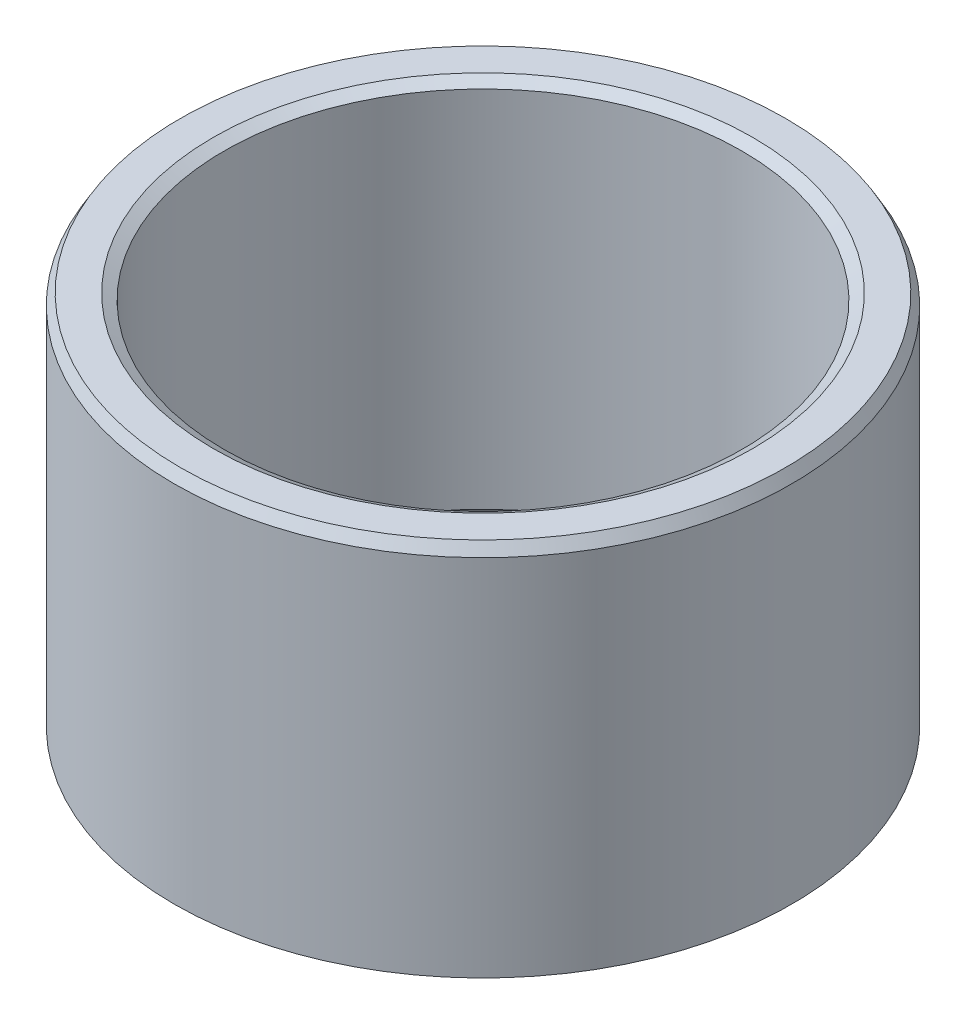
ISO-10303-21;
HEADER;
FILE_DESCRIPTION(('STEP AP214'),'2;1');
FILE_NAME('part.step','',(''),(''),'','','');
FILE_SCHEMA(('AUTOMOTIVE_DESIGN { 1 0 10303 214 1 1 1 1 }'));
ENDSEC;
DATA;
#1=APPLICATION_CONTEXT('core data for automotive mechanical design processes');
#2=APPLICATION_PROTOCOL_DEFINITION('international standard','automotive_design',2000,#1);
#3=PRODUCT_CONTEXT('',#1,'mechanical');
#4=PRODUCT('Part','Part','',(#3));
#5=PRODUCT_RELATED_PRODUCT_CATEGORY('part','',(#4));
#6=PRODUCT_DEFINITION_FORMATION('','',#4);
#7=PRODUCT_DEFINITION_CONTEXT('part definition',#1,'design');
#8=PRODUCT_DEFINITION('design','',#6,#7);
#9=PRODUCT_DEFINITION_SHAPE('','',#8);
#10=(LENGTH_UNIT() NAMED_UNIT(*) SI_UNIT(.MILLI.,.METRE.));
#11=(NAMED_UNIT(*) PLANE_ANGLE_UNIT() SI_UNIT($,.RADIAN.));
#12=(NAMED_UNIT(*) SI_UNIT($,.STERADIAN.) SOLID_ANGLE_UNIT());
#13=UNCERTAINTY_MEASURE_WITH_UNIT(LENGTH_MEASURE(1.E-05),#10,'distance_accuracy_value','');
#14=(GEOMETRIC_REPRESENTATION_CONTEXT(3) GLOBAL_UNCERTAINTY_ASSIGNED_CONTEXT((#13)) GLOBAL_UNIT_ASSIGNED_CONTEXT((#10,
#11,#12)) REPRESENTATION_CONTEXT('',''));
#15=CARTESIAN_POINT('',(0.,0.,0.));
#16=DIRECTION('',(0.,0.,1.));
#17=DIRECTION('',(1.,0.,0.));
#18=AXIS2_PLACEMENT_3D('',#15,#16,#17);
#19=CARTESIAN_POINT('',(0.,46.2879067131361,0.));
#20=DIRECTION('',(0.,-1.,0.));
#21=DIRECTION('',(0.,0.,-1.));
#22=AXIS2_PLACEMENT_3D('',#19,#20,#21);
#23=CYLINDRICAL_SURFACE('',#22,37.5);
#24=CARTESIAN_POINT('',(0.,0.763815531329169,0.));
#25=DIRECTION('',(0.,1.,0.));
#26=DIRECTION('',(0.,0.,1.));
#27=AXIS2_PLACEMENT_3D('',#24,#25,#26);
#28=CIRCLE('',#27,37.5);
#29=CARTESIAN_POINT('',(0.,0.763815531329162,-37.5));
#30=VERTEX_POINT('',#29);
#31=EDGE_CURVE('E10',#30,#30,#28,.T.);
#32=CARTESIAN_POINT('',(0.,44.9649394052639,0.));
#33=DIRECTION('',(0.,1.,0.));
#34=DIRECTION('',(0.,0.,1.));
#35=AXIS2_PLACEMENT_3D('',#32,#33,#34);
#36=CIRCLE('',#35,37.5);
#37=CARTESIAN_POINT('',(0.,44.9649394052639,-37.5));
#38=VERTEX_POINT('',#37);
#39=EDGE_CURVE('E50',#38,#38,#36,.F.);
#40=CARTESIAN_POINT('',(0.,0.763815531329162,-37.5));
#41=CARTESIAN_POINT('',(0.,1.22424390501598,-37.5));
#42=CARTESIAN_POINT('',(0.,1.6846722787028,-37.5));
#43=CARTESIAN_POINT('',(0.,2.60552902607644,-37.5));
#44=CARTESIAN_POINT('',(0.,3.06595739976326,-37.5));
#45=CARTESIAN_POINT('',(0.,3.9868141471369,-37.5));
#46=CARTESIAN_POINT('',(0.,4.44724252082372,-37.5));
#47=CARTESIAN_POINT('',(0.,5.36809926819736,-37.5));
#48=CARTESIAN_POINT('',(0.,5.82852764188418,-37.5));
#49=CARTESIAN_POINT('',(0.,6.74938438925782,-37.5));
#50=CARTESIAN_POINT('',(0.,7.20981276294464,-37.5));
#51=CARTESIAN_POINT('',(0.,8.13066951031829,-37.5));
#52=CARTESIAN_POINT('',(0.,8.59109788400511,-37.5));
#53=CARTESIAN_POINT('',(0.,9.51195463137875,-37.5));
#54=CARTESIAN_POINT('',(0.,9.97238300506557,-37.5));
#55=CARTESIAN_POINT('',(0.,10.8932397524392,-37.5));
#56=CARTESIAN_POINT('',(0.,11.353668126126,-37.5));
#57=CARTESIAN_POINT('',(0.,12.2745248734997,-37.5));
#58=CARTESIAN_POINT('',(0.,12.7349532471865,-37.5));
#59=CARTESIAN_POINT('',(0.,13.6558099945601,-37.5));
#60=CARTESIAN_POINT('',(0.,14.1162383682469,-37.5));
#61=CARTESIAN_POINT('',(0.,15.0370951156206,-37.5));
#62=CARTESIAN_POINT('',(0.,15.4975234893074,-37.5));
#63=CARTESIAN_POINT('',(0.,16.418380236681,-37.5));
#64=CARTESIAN_POINT('',(0.,16.8788086103679,-37.5));
#65=CARTESIAN_POINT('',(0.,17.7996653577415,-37.5));
#66=CARTESIAN_POINT('',(0.,18.2600937314283,-37.5));
#67=CARTESIAN_POINT('',(0.,19.180950478802,-37.5));
#68=CARTESIAN_POINT('',(0.,19.6413788524888,-37.5));
#69=CARTESIAN_POINT('',(0.,20.5622355998624,-37.5));
#70=CARTESIAN_POINT('',(0.,21.0226639735492,-37.5));
#71=CARTESIAN_POINT('',(0.,21.9435207209229,-37.5));
#72=CARTESIAN_POINT('',(0.,22.4039490946097,-37.5));
#73=CARTESIAN_POINT('',(0.,23.3248058419833,-37.5));
#74=CARTESIAN_POINT('',(0.,23.7852342156702,-37.5));
#75=CARTESIAN_POINT('',(0.,24.7060909630438,-37.5));
#76=CARTESIAN_POINT('',(0.,25.1665193367306,-37.5));
#77=CARTESIAN_POINT('',(0.,26.0873760841043,-37.5));
#78=CARTESIAN_POINT('',(0.,26.5478044577911,-37.5));
#79=CARTESIAN_POINT('',(0.,27.4686612051647,-37.5));
#80=CARTESIAN_POINT('',(0.,27.9290895788515,-37.5));
#81=CARTESIAN_POINT('',(0.,28.8499463262252,-37.5));
#82=CARTESIAN_POINT('',(0.,29.310374699912,-37.5));
#83=CARTESIAN_POINT('',(0.,30.2312314472856,-37.5));
#84=CARTESIAN_POINT('',(0.,30.6916598209725,-37.5));
#85=CARTESIAN_POINT('',(0.,31.6125165683461,-37.5));
#86=CARTESIAN_POINT('',(0.,32.0729449420329,-37.5));
#87=CARTESIAN_POINT('',(0.,32.9938016894066,-37.5));
#88=CARTESIAN_POINT('',(0.,33.4542300630934,-37.5));
#89=CARTESIAN_POINT('',(0.,34.375086810467,-37.5));
#90=CARTESIAN_POINT('',(0.,34.8355151841538,-37.5));
#91=CARTESIAN_POINT('',(0.,35.7563719315275,-37.5));
#92=CARTESIAN_POINT('',(0.,36.2168003052143,-37.5));
#93=CARTESIAN_POINT('',(0.,37.1376570525879,-37.5));
#94=CARTESIAN_POINT('',(0.,37.5980854262748,-37.5));
#95=CARTESIAN_POINT('',(0.,38.5189421736484,-37.5));
#96=CARTESIAN_POINT('',(0.,38.9793705473352,-37.5));
#97=CARTESIAN_POINT('',(0.,39.9002272947089,-37.5));
#98=CARTESIAN_POINT('',(0.,40.3606556683957,-37.5));
#99=CARTESIAN_POINT('',(0.,41.2815124157693,-37.5));
#100=CARTESIAN_POINT('',(0.,41.7419407894561,-37.5));
#101=CARTESIAN_POINT('',(0.,42.6627975368298,-37.5));
#102=CARTESIAN_POINT('',(0.,43.1232259105166,-37.5));
#103=CARTESIAN_POINT('',(0.,44.0440826578902,-37.5));
#104=CARTESIAN_POINT('',(0.,44.5045110315771,-37.5));
#105=CARTESIAN_POINT('',(0.,44.9649394052639,-37.5));
#106=B_SPLINE_CURVE_WITH_KNOTS('',3,(#40,#41,#42,#43,#44,#45,#46,#47,#48,#49,#50,#51,#52,#53,
#54,#55,#56,#57,#58,#59,#60,#61,#62,#63,#64,#65,#66,#67,#68,#69,#70,#71,#72,#73,#74,#75,#76,#77,
#78,#79,#80,#81,#82,#83,#84,#85,#86,#87,#88,#89,#90,#91,#92,#93,#94,#95,#96,#97,#98,#99,#100,
#101,#102,#103,#104,#105),.UNSPECIFIED.,.F.,.F.,(4,2,2,2,2,2,2,2,2,2,2,2,2,2,2,2,2,2,2,2,2,2,2,
2,2,2,2,2,2,2,2,2,4),(0.,1.38128512106046,2.76257024212092,4.14385536318138,5.52514048424184,
6.9064256053023,8.28771072636277,9.66899584742322,11.0502809684837,12.4315660895441,
13.8128512106046,15.1941363316651,16.5754214527255,17.956706573786,19.3379916948464,
20.7192768159069,22.1005619369674,23.4818470580278,24.8631321790883,26.2444173001487,
27.6257024212092,29.0069875422697,30.3882726633301,31.7695577843906,33.150842905451,
34.5321280265115,35.913413147572,37.2946982686324,38.6759833896929,40.0572685107533,
41.4385536318138,42.8198387528743,44.2011238739347),.UNSPECIFIED.);
#107=EDGE_CURVE('BSEAM39',#30,#38,#106,.T.);
#108=ORIENTED_EDGE('',*,*,#31,.T.);
#109=ORIENTED_EDGE('',*,*,#39,.T.);
#110=ORIENTED_EDGE('',*,*,#107,.T.);
#111=ORIENTED_EDGE('',*,*,#107,.F.);
#112=EDGE_LOOP('',(#108,#110,#109,#111));
#113=FACE_BOUND('',#112,.T.);
#114=ADVANCED_FACE('F39',(#113),#23,.T.);
#115=CARTESIAN_POINT('',(0.,46.2879067131361,0.));
#116=DIRECTION('',(0.,1.,0.));
#117=DIRECTION('',(0.,0.,1.));
#118=AXIS2_PLACEMENT_3D('',#115,#116,#117);
#119=PLANE('',#118);
#120=CARTESIAN_POINT('',(0.,46.2879067131361,0.));
#121=DIRECTION('',(0.,1.,0.));
#122=DIRECTION('',(0.,0.,1.));
#123=AXIS2_PLACEMENT_3D('',#120,#121,#122);
#124=CIRCLE('',#123,32.7452708070368);
#125=CARTESIAN_POINT('',(0.,46.2879067131361,32.7452708070368));
#126=VERTEX_POINT('',#125);
#127=EDGE_CURVE('E58',#126,#126,#124,.F.);
#128=ORIENTED_EDGE('',*,*,#127,.T.);
#129=EDGE_LOOP('',(#128));
#130=FACE_BOUND('',#129,.T.);
#131=CARTESIAN_POINT('',(0.,46.2879067131361,0.));
#132=DIRECTION('',(0.,1.,0.));
#133=DIRECTION('',(0.,0.,1.));
#134=AXIS2_PLACEMENT_3D('',#131,#132,#133);
#135=CIRCLE('',#134,36.7361844686709);
#136=CARTESIAN_POINT('',(0.,46.2879067131361,36.7361844686709));
#137=VERTEX_POINT('',#136);
#138=EDGE_CURVE('E61',#137,#137,#135,.T.);
#139=ORIENTED_EDGE('',*,*,#138,.T.);
#140=EDGE_LOOP('',(#139));
#141=FACE_BOUND('',#140,.T.);
#142=ADVANCED_FACE('F88',(#130,#141),#119,.T.);
#143=CARTESIAN_POINT('',(0.,0.,0.));
#144=DIRECTION('',(0.,1.,0.));
#145=DIRECTION('',(0.,0.,1.));
#146=AXIS2_PLACEMENT_3D('',#143,#144,#145);
#147=PLANE('',#146);
#148=CARTESIAN_POINT('',(0.,0.,0.));
#149=DIRECTION('',(0.,1.,0.));
#150=DIRECTION('',(0.,0.,1.));
#151=AXIS2_PLACEMENT_3D('',#148,#149,#150);
#152=CIRCLE('',#151,32.1861190304936);
#153=CARTESIAN_POINT('',(0.,0.,32.1861190304936));
#154=VERTEX_POINT('',#153);
#155=EDGE_CURVE('E51',#154,#154,#152,.T.);
#156=ORIENTED_EDGE('',*,*,#155,.T.);
#157=EDGE_LOOP('',(#156));
#158=FACE_BOUND('',#157,.T.);
#159=CARTESIAN_POINT('',(0.,0.,0.));
#160=DIRECTION('',(0.,1.,0.));
#161=DIRECTION('',(0.,0.,1.));
#162=AXIS2_PLACEMENT_3D('',#159,#160,#161);
#163=CIRCLE('',#162,36.1770326921277);
#164=CARTESIAN_POINT('',(0.,0.,36.1770326921277));
#165=VERTEX_POINT('',#164);
#166=EDGE_CURVE('E54',#165,#165,#163,.F.);
#167=ORIENTED_EDGE('',*,*,#166,.T.);
#168=EDGE_LOOP('',(#167));
#169=FACE_BOUND('',#168,.T.);
#170=ADVANCED_FACE('F83',(#158,#169),#147,.F.);
#171=CARTESIAN_POINT('',(0.,46.2879067131361,0.));
#172=DIRECTION('',(0.,-1.,0.));
#173=DIRECTION('',(0.,0.,-1.));
#174=AXIS2_PLACEMENT_3D('',#171,#172,#173);
#175=CYLINDRICAL_SURFACE('',#174,31.4223034991645);
#176=CARTESIAN_POINT('',(0.,45.5240911818069,0.));
#177=DIRECTION('',(0.,1.,0.));
#178=DIRECTION('',(0.,0.,1.));
#179=AXIS2_PLACEMENT_3D('',#176,#177,#178);
#180=CIRCLE('',#179,31.4223034991645);
#181=CARTESIAN_POINT('',(0.,45.5240911818069,-31.4223034991645));
#182=VERTEX_POINT('',#181);
#183=EDGE_CURVE('E67',#182,#182,#180,.T.);
#184=CARTESIAN_POINT('',(0.,1.32296730787226,0.));
#185=DIRECTION('',(0.,1.,0.));
#186=DIRECTION('',(0.,0.,1.));
#187=AXIS2_PLACEMENT_3D('',#184,#185,#186);
#188=CIRCLE('',#187,31.4223034991645);
#189=CARTESIAN_POINT('',(0.,1.32296730787225,-31.4223034991645));
#190=VERTEX_POINT('',#189);
#191=EDGE_CURVE('E69',#190,#190,#188,.F.);
#192=CARTESIAN_POINT('',(0.,45.5240911818069,-31.4223034991645));
#193=CARTESIAN_POINT('',(0.,45.0636628081201,-31.4223034991645));
#194=CARTESIAN_POINT('',(0.,44.6032344344333,-31.4223034991645));
#195=CARTESIAN_POINT('',(0.,43.6823776870597,-31.4223034991645));
#196=CARTESIAN_POINT('',(0.,43.2219493133728,-31.4223034991645));
#197=CARTESIAN_POINT('',(0.,42.3010925659992,-31.4223034991645));
#198=CARTESIAN_POINT('',(0.,41.8406641923124,-31.4223034991645));
#199=CARTESIAN_POINT('',(0.,40.9198074449387,-31.4223034991645));
#200=CARTESIAN_POINT('',(0.,40.4593790712519,-31.4223034991645));
#201=CARTESIAN_POINT('',(0.,39.5385223238783,-31.4223034991645));
#202=CARTESIAN_POINT('',(0.,39.0780939501915,-31.4223034991645));
#203=CARTESIAN_POINT('',(0.,38.1572372028178,-31.4223034991645));
#204=CARTESIAN_POINT('',(0.,37.696808829131,-31.4223034991645));
#205=CARTESIAN_POINT('',(0.,36.7759520817574,-31.4223034991645));
#206=CARTESIAN_POINT('',(0.,36.3155237080706,-31.4223034991645));
#207=CARTESIAN_POINT('',(0.,35.3946669606969,-31.4223034991645));
#208=CARTESIAN_POINT('',(0.,34.9342385870101,-31.4223034991645));
#209=CARTESIAN_POINT('',(0.,34.0133818396365,-31.4223034991645));
#210=CARTESIAN_POINT('',(0.,33.5529534659496,-31.4223034991645));
#211=CARTESIAN_POINT('',(0.,32.632096718576,-31.4223034991645));
#212=CARTESIAN_POINT('',(0.,32.1716683448892,-31.4223034991645));
#213=CARTESIAN_POINT('',(0.,31.2508115975155,-31.4223034991645));
#214=CARTESIAN_POINT('',(0.,30.7903832238287,-31.4223034991645));
#215=CARTESIAN_POINT('',(0.,29.8695264764551,-31.4223034991645));
#216=CARTESIAN_POINT('',(0.,29.4090981027683,-31.4223034991645));
#217=CARTESIAN_POINT('',(0.,28.4882413553946,-31.4223034991645));
#218=CARTESIAN_POINT('',(0.,28.0278129817078,-31.4223034991645));
#219=CARTESIAN_POINT('',(0.,27.1069562343342,-31.4223034991645));
#220=CARTESIAN_POINT('',(0.,26.6465278606473,-31.4223034991645));
#221=CARTESIAN_POINT('',(0.,25.7256711132737,-31.4223034991645));
#222=CARTESIAN_POINT('',(0.,25.2652427395869,-31.4223034991645));
#223=CARTESIAN_POINT('',(0.,24.3443859922132,-31.4223034991645));
#224=CARTESIAN_POINT('',(0.,23.8839576185264,-31.4223034991645));
#225=CARTESIAN_POINT('',(0.,22.9631008711528,-31.4223034991645));
#226=CARTESIAN_POINT('',(0.,22.502672497466,-31.4223034991645));
#227=CARTESIAN_POINT('',(0.,21.5818157500923,-31.4223034991645));
#228=CARTESIAN_POINT('',(0.,21.1213873764055,-31.4223034991645));
#229=CARTESIAN_POINT('',(0.,20.2005306290319,-31.4223034991645));
#230=CARTESIAN_POINT('',(0.,19.740102255345,-31.4223034991645));
#231=CARTESIAN_POINT('',(0.,18.8192455079714,-31.4223034991645));
#232=CARTESIAN_POINT('',(0.,18.3588171342846,-31.4223034991645));
#233=CARTESIAN_POINT('',(0.,17.4379603869109,-31.4223034991645));
#234=CARTESIAN_POINT('',(0.,16.9775320132241,-31.4223034991645));
#235=CARTESIAN_POINT('',(0.,16.0566752658505,-31.4223034991645));
#236=CARTESIAN_POINT('',(0.,15.5962468921637,-31.4223034991645));
#237=CARTESIAN_POINT('',(0.,14.67539014479,-31.4223034991645));
#238=CARTESIAN_POINT('',(0.,14.2149617711032,-31.4223034991645));
#239=CARTESIAN_POINT('',(0.,13.2941050237296,-31.4223034991645));
#240=CARTESIAN_POINT('',(0.,12.8336766500427,-31.4223034991645));
#241=CARTESIAN_POINT('',(0.,11.9128199026691,-31.4223034991645));
#242=CARTESIAN_POINT('',(0.,11.4523915289823,-31.4223034991645));
#243=CARTESIAN_POINT('',(0.,10.5315347816086,-31.4223034991645));
#244=CARTESIAN_POINT('',(0.,10.0711064079218,-31.4223034991645));
#245=CARTESIAN_POINT('',(0.,9.15024966054819,-31.4223034991645));
#246=CARTESIAN_POINT('',(0.,8.68982128686137,-31.4223034991645));
#247=CARTESIAN_POINT('',(0.,7.76896453948773,-31.4223034991645));
#248=CARTESIAN_POINT('',(0.,7.30853616580091,-31.4223034991645));
#249=CARTESIAN_POINT('',(0.,6.38767941842727,-31.4223034991645));
#250=CARTESIAN_POINT('',(0.,5.92725104474045,-31.4223034991645));
#251=CARTESIAN_POINT('',(0.,5.00639429736681,-31.4223034991645));
#252=CARTESIAN_POINT('',(0.,4.54596592367999,-31.4223034991645));
#253=CARTESIAN_POINT('',(0.,3.62510917630635,-31.4223034991645));
#254=CARTESIAN_POINT('',(0.,3.16468080261953,-31.4223034991645));
#255=CARTESIAN_POINT('',(0.,2.24382405524589,-31.4223034991645));
#256=CARTESIAN_POINT('',(0.,1.78339568155907,-31.4223034991645));
#257=CARTESIAN_POINT('',(0.,1.32296730787225,-31.4223034991645));
#258=B_SPLINE_CURVE_WITH_KNOTS('',3,(#192,#193,#194,#195,#196,#197,#198,#199,#200,#201,#202,
#203,#204,#205,#206,#207,#208,#209,#210,#211,#212,#213,#214,#215,#216,#217,#218,#219,#220,#221,
#222,#223,#224,#225,#226,#227,#228,#229,#230,#231,#232,#233,#234,#235,#236,#237,#238,#239,#240,
#241,#242,#243,#244,#245,#246,#247,#248,#249,#250,#251,#252,#253,#254,#255,#256,#257),
.UNSPECIFIED.,.F.,.F.,(4,2,2,2,2,2,2,2,2,2,2,2,2,2,2,2,2,2,2,2,2,2,2,2,2,2,2,2,2,2,2,2,4),(0.,
1.38128512106046,2.76257024212091,4.14385536318138,5.52514048424183,6.90642560530229,
8.28771072636275,9.66899584742321,11.0502809684837,12.4315660895441,13.8128512106046,
15.194136331665,16.5754214527255,17.956706573786,19.3379916948464,20.7192768159069,
22.1005619369673,23.4818470580278,24.8631321790883,26.2444173001487,27.6257024212092,
29.0069875422696,30.3882726633301,31.7695577843906,33.150842905451,34.5321280265115,
35.9134131475719,37.2946982686324,38.6759833896929,40.0572685107533,41.4385536318138,
42.8198387528742,44.2011238739347),.UNSPECIFIED.);
#259=EDGE_CURVE('BSEAM71',#182,#190,#258,.T.);
#260=ORIENTED_EDGE('',*,*,#183,.T.);
#261=ORIENTED_EDGE('',*,*,#191,.T.);
#262=ORIENTED_EDGE('',*,*,#259,.T.);
#263=ORIENTED_EDGE('',*,*,#259,.F.);
#264=EDGE_LOOP('',(#260,#262,#261,#263));
#265=FACE_BOUND('',#264,.T.);
#266=ADVANCED_FACE('F71',(#265),#175,.F.);
#267=CARTESIAN_POINT('',(0.,45.5240911818069,0.));
#268=DIRECTION('',(0.,1.,0.));
#269=DIRECTION('',(0.,0.,1.));
#270=AXIS2_PLACEMENT_3D('',#267,#268,#269);
#271=CONICAL_SURFACE('',#270,31.4223034991645,1.0471975511966);
#272=ORIENTED_EDGE('',*,*,#127,.F.);
#273=EDGE_LOOP('',(#272));
#274=FACE_BOUND('',#273,.T.);
#275=ORIENTED_EDGE('',*,*,#183,.F.);
#276=EDGE_LOOP('',(#275));
#277=FACE_BOUND('',#276,.T.);
#278=ADVANCED_FACE('F77',(#274,#277),#271,.F.);
#279=CARTESIAN_POINT('',(0.,0.,0.));
#280=DIRECTION('',(0.,-1.,0.));
#281=DIRECTION('',(0.,0.,-1.));
#282=AXIS2_PLACEMENT_3D('',#279,#280,#281);
#283=CONICAL_SURFACE('',#282,32.1861190304936,0.523598775598294);
#284=ORIENTED_EDGE('',*,*,#191,.F.);
#285=EDGE_LOOP('',(#284));
#286=FACE_BOUND('',#285,.T.);
#287=ORIENTED_EDGE('',*,*,#155,.F.);
#288=EDGE_LOOP('',(#287));
#289=FACE_BOUND('',#288,.T.);
#290=ADVANCED_FACE('F73',(#286,#289),#283,.F.);
#291=CARTESIAN_POINT('',(0.,0.763815531329169,0.));
#292=DIRECTION('',(0.,1.,0.));
#293=DIRECTION('',(0.,0.,1.));
#294=AXIS2_PLACEMENT_3D('',#291,#292,#293);
#295=CONICAL_SURFACE('',#294,37.5,1.0471975511966);
#296=ORIENTED_EDGE('',*,*,#166,.F.);
#297=EDGE_LOOP('',(#296));
#298=FACE_BOUND('',#297,.T.);
#299=ORIENTED_EDGE('',*,*,#31,.F.);
#300=EDGE_LOOP('',(#299));
#301=FACE_BOUND('',#300,.T.);
#302=ADVANCED_FACE('F76',(#298,#301),#295,.T.);
#303=CARTESIAN_POINT('',(0.,46.2879067131361,0.));
#304=DIRECTION('',(0.,-1.,0.));
#305=DIRECTION('',(0.,0.,-1.));
#306=AXIS2_PLACEMENT_3D('',#303,#304,#305);
#307=CONICAL_SURFACE('',#306,36.7361844686709,0.523598775598293);
#308=ORIENTED_EDGE('',*,*,#39,.F.);
#309=EDGE_LOOP('',(#308));
#310=FACE_BOUND('',#309,.T.);
#311=ORIENTED_EDGE('',*,*,#138,.F.);
#312=EDGE_LOOP('',(#311));
#313=FACE_BOUND('',#312,.T.);
#314=ADVANCED_FACE('F45',(#310,#313),#307,.T.);
#315=CLOSED_SHELL('',(#114,#142,#170,#266,#278,#290,#302,#314));
#316=MANIFOLD_SOLID_BREP('B2',#315);
#317=ADVANCED_BREP_SHAPE_REPRESENTATION('',(#18,#316),#14);
#318=SHAPE_DEFINITION_REPRESENTATION(#9,#317);
ENDSEC;
END-ISO-10303-21;
